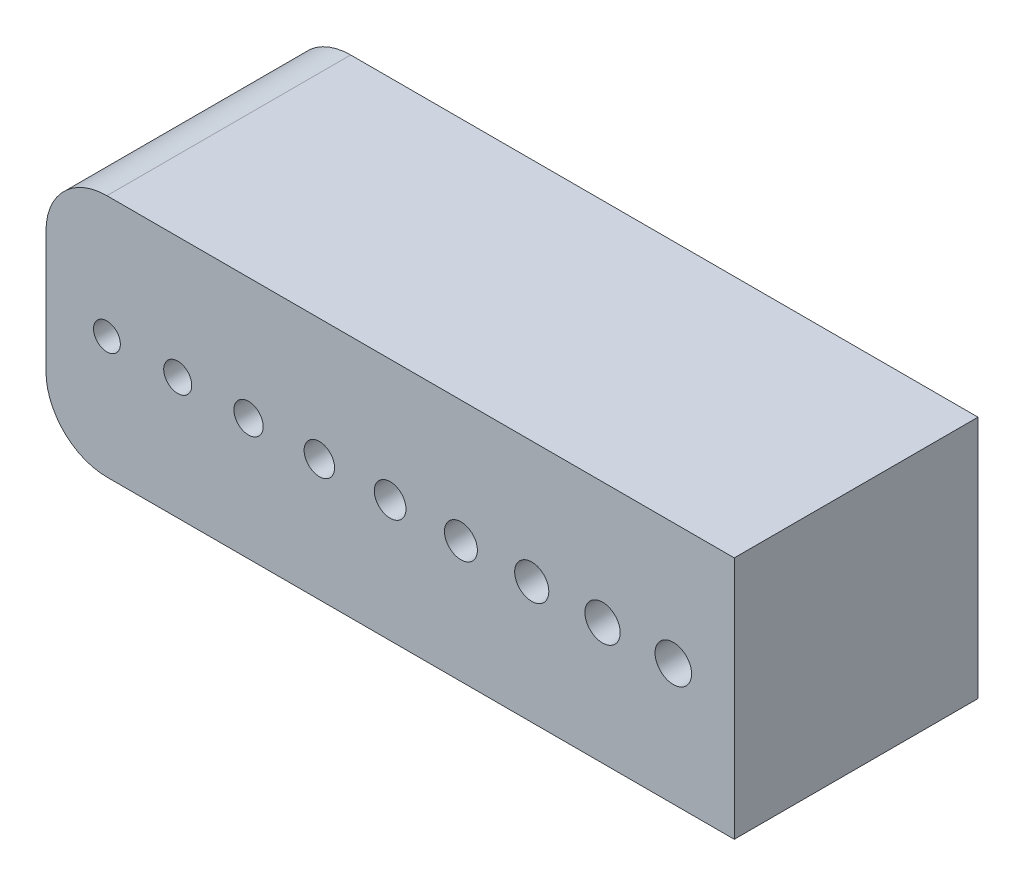
ISO-10303-21;
HEADER;
FILE_DESCRIPTION(('STEP AP214'),'2;1');
FILE_NAME('part.step','',(''),(''),'','','');
FILE_SCHEMA(('AUTOMOTIVE_DESIGN { 1 0 10303 214 1 1 1 1 }'));
ENDSEC;
DATA;
#1=APPLICATION_CONTEXT('core data for automotive mechanical design processes');
#2=APPLICATION_PROTOCOL_DEFINITION('international standard','automotive_design',2000,#1);
#3=PRODUCT_CONTEXT('',#1,'mechanical');
#4=PRODUCT('Part','Part','',(#3));
#5=PRODUCT_RELATED_PRODUCT_CATEGORY('part','',(#4));
#6=PRODUCT_DEFINITION_FORMATION('','',#4);
#7=PRODUCT_DEFINITION_CONTEXT('part definition',#1,'design');
#8=PRODUCT_DEFINITION('design','',#6,#7);
#9=PRODUCT_DEFINITION_SHAPE('','',#8);
#10=(LENGTH_UNIT() NAMED_UNIT(*) SI_UNIT(.MILLI.,.METRE.));
#11=(NAMED_UNIT(*) PLANE_ANGLE_UNIT() SI_UNIT($,.RADIAN.));
#12=(NAMED_UNIT(*) SI_UNIT($,.STERADIAN.) SOLID_ANGLE_UNIT());
#13=UNCERTAINTY_MEASURE_WITH_UNIT(LENGTH_MEASURE(1.E-05),#10,'distance_accuracy_value','');
#14=(GEOMETRIC_REPRESENTATION_CONTEXT(3) GLOBAL_UNCERTAINTY_ASSIGNED_CONTEXT((#13)) GLOBAL_UNIT_ASSIGNED_CONTEXT((#10,
#11,#12)) REPRESENTATION_CONTEXT('',''));
#15=CARTESIAN_POINT('',(0.,0.,0.));
#16=DIRECTION('',(0.,0.,1.));
#17=DIRECTION('',(1.,0.,0.));
#18=AXIS2_PLACEMENT_3D('',#15,#16,#17);
#19=CARTESIAN_POINT('',(-23.238249127685,5.,20.));
#20=DIRECTION('',(0.,0.,-1.));
#21=DIRECTION('',(-1.,0.,0.));
#22=AXIS2_PLACEMENT_3D('',#19,#20,#21);
#23=PLANE('',#22);
#24=DIRECTION('',(0.,1.,0.));
#25=VECTOR('',#24,1.);
#26=CARTESIAN_POINT('',(28.238249127685,-10.,20.));
#27=LINE('',#26,#25);
#28=CARTESIAN_POINT('',(28.238249127685,-10.,20.));
#29=VERTEX_POINT('',#28);
#30=CARTESIAN_POINT('',(28.238249127685,10.,20.));
#31=VERTEX_POINT('',#30);
#32=EDGE_CURVE('E146',#29,#31,#27,.T.);
#33=ORIENTED_EDGE('',*,*,#32,.T.);
#34=DIRECTION('',(-1.,0.,0.));
#35=VECTOR('',#34,1.);
#36=CARTESIAN_POINT('',(-23.238249127685,10.,20.));
#37=LINE('',#36,#35);
#38=CARTESIAN_POINT('',(-23.238249127685,10.,20.));
#39=VERTEX_POINT('',#38);
#40=EDGE_CURVE('E94',#31,#39,#37,.T.);
#41=ORIENTED_EDGE('',*,*,#40,.T.);
#42=CARTESIAN_POINT('',(-23.238249127685,5.,20.));
#43=DIRECTION('',(0.,0.,1.));
#44=DIRECTION('',(-1.,0.,0.));
#45=AXIS2_PLACEMENT_3D('',#42,#43,#44);
#46=CIRCLE('',#45,5.);
#47=CARTESIAN_POINT('',(-28.238249127685,4.99999999999997,20.));
#48=VERTEX_POINT('',#47);
#49=EDGE_CURVE('E107',#39,#48,#46,.T.);
#50=ORIENTED_EDGE('',*,*,#49,.T.);
#51=DIRECTION('',(0.,-1.,0.));
#52=VECTOR('',#51,1.);
#53=CARTESIAN_POINT('',(-28.238249127685,-4.99999999999997,20.));
#54=LINE('',#53,#52);
#55=CARTESIAN_POINT('',(-28.238249127685,-4.99999999999997,20.));
#56=VERTEX_POINT('',#55);
#57=EDGE_CURVE('E101',#48,#56,#54,.T.);
#58=ORIENTED_EDGE('',*,*,#57,.T.);
#59=CARTESIAN_POINT('',(-23.238249127685,-5.,20.));
#60=DIRECTION('',(0.,0.,1.));
#61=DIRECTION('',(-1.,0.,0.));
#62=AXIS2_PLACEMENT_3D('',#59,#60,#61);
#63=CIRCLE('',#62,5.);
#64=CARTESIAN_POINT('',(-23.238249127685,-10.,20.));
#65=VERTEX_POINT('',#64);
#66=EDGE_CURVE('E105',#56,#65,#63,.T.);
#67=ORIENTED_EDGE('',*,*,#66,.T.);
#68=DIRECTION('',(1.,0.,0.));
#69=VECTOR('',#68,1.);
#70=CARTESIAN_POINT('',(-23.238249127685,-10.,20.));
#71=LINE('',#70,#69);
#72=EDGE_CURVE('E57',#65,#29,#71,.T.);
#73=ORIENTED_EDGE('',*,*,#72,.T.);
#74=EDGE_LOOP('',(#33,#41,#50,#58,#67,#73));
#75=FACE_BOUND('',#74,.T.);
#76=CARTESIAN_POINT('',(-23.238249127685,0.,20.));
#77=DIRECTION('',(0.,0.,1.));
#78=DIRECTION('',(1.,0.,0.));
#79=AXIS2_PLACEMENT_3D('',#76,#77,#78);
#80=CIRCLE('',#79,1.1);
#81=CARTESIAN_POINT('',(-22.138249127685,0.,20.));
#82=VERTEX_POINT('',#81);
#83=EDGE_CURVE('E134',#82,#82,#80,.T.);
#84=ORIENTED_EDGE('',*,*,#83,.F.);
#85=EDGE_LOOP('',(#84));
#86=FACE_BOUND('',#85,.T.);
#87=CARTESIAN_POINT('',(-17.4286868457638,0.,20.));
#88=DIRECTION('',(0.,0.,1.));
#89=DIRECTION('',(1.,0.,0.));
#90=AXIS2_PLACEMENT_3D('',#87,#88,#89);
#91=CIRCLE('',#90,1.15);
#92=CARTESIAN_POINT('',(-16.2786868457638,0.,20.));
#93=VERTEX_POINT('',#92);
#94=EDGE_CURVE('E278',#93,#93,#91,.T.);
#95=ORIENTED_EDGE('',*,*,#94,.F.);
#96=EDGE_LOOP('',(#95));
#97=FACE_BOUND('',#96,.T.);
#98=CARTESIAN_POINT('',(-11.6191245638465,0.,20.));
#99=DIRECTION('',(0.,0.,1.));
#100=DIRECTION('',(1.,0.,0.));
#101=AXIS2_PLACEMENT_3D('',#98,#99,#100);
#102=CIRCLE('',#101,1.2);
#103=CARTESIAN_POINT('',(-10.4191245638465,0.,20.));
#104=VERTEX_POINT('',#103);
#105=EDGE_CURVE('E270',#104,#104,#102,.T.);
#106=ORIENTED_EDGE('',*,*,#105,.F.);
#107=EDGE_LOOP('',(#106));
#108=FACE_BOUND('',#107,.T.);
#109=CARTESIAN_POINT('',(-5.80956228192125,0.,20.));
#110=DIRECTION('',(0.,0.,1.));
#111=DIRECTION('',(1.,0.,0.));
#112=AXIS2_PLACEMENT_3D('',#109,#110,#111);
#113=CIRCLE('',#112,1.25);
#114=CARTESIAN_POINT('',(-4.55956228192125,0.,20.));
#115=VERTEX_POINT('',#114);
#116=EDGE_CURVE('E262',#115,#115,#113,.T.);
#117=ORIENTED_EDGE('',*,*,#116,.F.);
#118=EDGE_LOOP('',(#117));
#119=FACE_BOUND('',#118,.T.);
#120=CARTESIAN_POINT('',(0.,0.,20.));
#121=DIRECTION('',(0.,0.,1.));
#122=DIRECTION('',(1.,0.,0.));
#123=AXIS2_PLACEMENT_3D('',#120,#121,#122);
#124=CIRCLE('',#123,1.3);
#125=CARTESIAN_POINT('',(1.30000000000001,0.,20.));
#126=VERTEX_POINT('',#125);
#127=EDGE_CURVE('E254',#126,#126,#124,.T.);
#128=ORIENTED_EDGE('',*,*,#127,.F.);
#129=EDGE_LOOP('',(#128));
#130=FACE_BOUND('',#129,.T.);
#131=CARTESIAN_POINT('',(5.80956228192126,0.,20.));
#132=DIRECTION('',(0.,0.,1.));
#133=DIRECTION('',(1.,0.,0.));
#134=AXIS2_PLACEMENT_3D('',#131,#132,#133);
#135=CIRCLE('',#134,1.35);
#136=CARTESIAN_POINT('',(7.15956228192126,0.,20.));
#137=VERTEX_POINT('',#136);
#138=EDGE_CURVE('E246',#137,#137,#135,.T.);
#139=ORIENTED_EDGE('',*,*,#138,.F.);
#140=EDGE_LOOP('',(#139));
#141=FACE_BOUND('',#140,.T.);
#142=CARTESIAN_POINT('',(11.6191245638465,0.,20.));
#143=DIRECTION('',(0.,0.,1.));
#144=DIRECTION('',(1.,0.,0.));
#145=AXIS2_PLACEMENT_3D('',#142,#143,#144);
#146=CIRCLE('',#145,1.4);
#147=CARTESIAN_POINT('',(13.0191245638465,0.,20.));
#148=VERTEX_POINT('',#147);
#149=EDGE_CURVE('E238',#148,#148,#146,.T.);
#150=ORIENTED_EDGE('',*,*,#149,.F.);
#151=EDGE_LOOP('',(#150));
#152=FACE_BOUND('',#151,.T.);
#153=CARTESIAN_POINT('',(17.4286868457638,0.,20.));
#154=DIRECTION('',(0.,0.,1.));
#155=DIRECTION('',(1.,0.,0.));
#156=AXIS2_PLACEMENT_3D('',#153,#154,#155);
#157=CIRCLE('',#156,1.45);
#158=CARTESIAN_POINT('',(18.8786868457638,0.,20.));
#159=VERTEX_POINT('',#158);
#160=EDGE_CURVE('E230',#159,#159,#157,.T.);
#161=ORIENTED_EDGE('',*,*,#160,.F.);
#162=EDGE_LOOP('',(#161));
#163=FACE_BOUND('',#162,.T.);
#164=CARTESIAN_POINT('',(23.2382491276787,0.,20.));
#165=DIRECTION('',(0.,0.,1.));
#166=DIRECTION('',(1.,0.,0.));
#167=AXIS2_PLACEMENT_3D('',#164,#165,#166);
#168=CIRCLE('',#167,1.5);
#169=CARTESIAN_POINT('',(24.7382491276787,0.,20.));
#170=VERTEX_POINT('',#169);
#171=EDGE_CURVE('E219',#170,#170,#168,.T.);
#172=ORIENTED_EDGE('',*,*,#171,.F.);
#173=EDGE_LOOP('',(#172));
#174=FACE_BOUND('',#173,.T.);
#175=ADVANCED_FACE('F39',(#75,#86,#97,#108,#119,#130,#141,#152,#163,#174),#23,.F.);
#176=CARTESIAN_POINT('',(-23.238249127685,5.,0.));
#177=DIRECTION('',(0.,0.,-1.));
#178=DIRECTION('',(-1.,0.,0.));
#179=AXIS2_PLACEMENT_3D('',#176,#177,#178);
#180=PLANE('',#179);
#181=CARTESIAN_POINT('',(17.4286868457638,0.,0.));
#182=DIRECTION('',(0.,0.,1.));
#183=DIRECTION('',(1.,0.,0.));
#184=AXIS2_PLACEMENT_3D('',#181,#182,#183);
#185=CIRCLE('',#184,1.45);
#186=CARTESIAN_POINT('',(18.8786868457638,0.,0.));
#187=VERTEX_POINT('',#186);
#188=EDGE_CURVE('E227',#187,#187,#185,.T.);
#189=ORIENTED_EDGE('',*,*,#188,.T.);
#190=EDGE_LOOP('',(#189));
#191=FACE_BOUND('',#190,.T.);
#192=CARTESIAN_POINT('',(5.80956228192126,0.,0.));
#193=DIRECTION('',(0.,0.,1.));
#194=DIRECTION('',(1.,0.,0.));
#195=AXIS2_PLACEMENT_3D('',#192,#193,#194);
#196=CIRCLE('',#195,1.35);
#197=CARTESIAN_POINT('',(7.15956228192126,0.,0.));
#198=VERTEX_POINT('',#197);
#199=EDGE_CURVE('E242',#198,#198,#196,.T.);
#200=ORIENTED_EDGE('',*,*,#199,.T.);
#201=EDGE_LOOP('',(#200));
#202=FACE_BOUND('',#201,.T.);
#203=CARTESIAN_POINT('',(-5.80956228192125,0.,0.));
#204=DIRECTION('',(0.,0.,1.));
#205=DIRECTION('',(1.,0.,0.));
#206=AXIS2_PLACEMENT_3D('',#203,#204,#205);
#207=CIRCLE('',#206,1.25);
#208=CARTESIAN_POINT('',(-4.55956228192125,0.,0.));
#209=VERTEX_POINT('',#208);
#210=EDGE_CURVE('E258',#209,#209,#207,.T.);
#211=ORIENTED_EDGE('',*,*,#210,.T.);
#212=EDGE_LOOP('',(#211));
#213=FACE_BOUND('',#212,.T.);
#214=CARTESIAN_POINT('',(-17.4286868457638,0.,0.));
#215=DIRECTION('',(0.,0.,1.));
#216=DIRECTION('',(1.,0.,0.));
#217=AXIS2_PLACEMENT_3D('',#214,#215,#216);
#218=CIRCLE('',#217,1.15);
#219=CARTESIAN_POINT('',(-16.2786868457638,0.,0.));
#220=VERTEX_POINT('',#219);
#221=EDGE_CURVE('E274',#220,#220,#218,.T.);
#222=ORIENTED_EDGE('',*,*,#221,.T.);
#223=EDGE_LOOP('',(#222));
#224=FACE_BOUND('',#223,.T.);
#225=DIRECTION('',(0.,1.,0.));
#226=VECTOR('',#225,1.);
#227=CARTESIAN_POINT('',(28.238249127685,-10.,0.));
#228=LINE('',#227,#226);
#229=CARTESIAN_POINT('',(28.238249127685,-10.,0.));
#230=VERTEX_POINT('',#229);
#231=CARTESIAN_POINT('',(28.238249127685,10.,0.));
#232=VERTEX_POINT('',#231);
#233=EDGE_CURVE('E129',#230,#232,#228,.T.);
#234=ORIENTED_EDGE('',*,*,#233,.F.);
#235=DIRECTION('',(1.,0.,0.));
#236=VECTOR('',#235,1.);
#237=CARTESIAN_POINT('',(-23.238249127685,-10.,0.));
#238=LINE('',#237,#236);
#239=CARTESIAN_POINT('',(-23.238249127685,-10.,0.));
#240=VERTEX_POINT('',#239);
#241=EDGE_CURVE('E86',#240,#230,#238,.T.);
#242=ORIENTED_EDGE('',*,*,#241,.F.);
#243=CARTESIAN_POINT('',(-23.238249127685,-5.,0.));
#244=DIRECTION('',(0.,0.,1.));
#245=DIRECTION('',(-1.,0.,0.));
#246=AXIS2_PLACEMENT_3D('',#243,#244,#245);
#247=CIRCLE('',#246,5.);
#248=CARTESIAN_POINT('',(-28.238249127685,-4.99999999999997,0.));
#249=VERTEX_POINT('',#248);
#250=EDGE_CURVE('E80',#249,#240,#247,.T.);
#251=ORIENTED_EDGE('',*,*,#250,.F.);
#252=DIRECTION('',(0.,-1.,0.));
#253=VECTOR('',#252,1.);
#254=CARTESIAN_POINT('',(-28.238249127685,-4.99999999999997,0.));
#255=LINE('',#254,#253);
#256=CARTESIAN_POINT('',(-28.238249127685,4.99999999999997,0.));
#257=VERTEX_POINT('',#256);
#258=EDGE_CURVE('E116',#257,#249,#255,.T.);
#259=ORIENTED_EDGE('',*,*,#258,.F.);
#260=CARTESIAN_POINT('',(-23.238249127685,5.,0.));
#261=DIRECTION('',(0.,0.,1.));
#262=DIRECTION('',(-1.,0.,0.));
#263=AXIS2_PLACEMENT_3D('',#260,#261,#262);
#264=CIRCLE('',#263,5.);
#265=CARTESIAN_POINT('',(-23.238249127685,10.,0.));
#266=VERTEX_POINT('',#265);
#267=EDGE_CURVE('E137',#266,#257,#264,.T.);
#268=ORIENTED_EDGE('',*,*,#267,.F.);
#269=DIRECTION('',(-1.,0.,0.));
#270=VECTOR('',#269,1.);
#271=CARTESIAN_POINT('',(-23.238249127685,10.,0.));
#272=LINE('',#271,#270);
#273=EDGE_CURVE('E133',#232,#266,#272,.T.);
#274=ORIENTED_EDGE('',*,*,#273,.F.);
#275=EDGE_LOOP('',(#234,#242,#251,#259,#268,#274));
#276=FACE_BOUND('',#275,.T.);
#277=CARTESIAN_POINT('',(-23.238249127685,0.,0.));
#278=DIRECTION('',(0.,0.,1.));
#279=DIRECTION('',(1.,0.,0.));
#280=AXIS2_PLACEMENT_3D('',#277,#278,#279);
#281=CIRCLE('',#280,1.1);
#282=CARTESIAN_POINT('',(-22.138249127685,0.,0.));
#283=VERTEX_POINT('',#282);
#284=EDGE_CURVE('E282',#283,#283,#281,.T.);
#285=ORIENTED_EDGE('',*,*,#284,.T.);
#286=EDGE_LOOP('',(#285));
#287=FACE_BOUND('',#286,.T.);
#288=CARTESIAN_POINT('',(-11.6191245638465,0.,0.));
#289=DIRECTION('',(0.,0.,1.));
#290=DIRECTION('',(1.,0.,0.));
#291=AXIS2_PLACEMENT_3D('',#288,#289,#290);
#292=CIRCLE('',#291,1.2);
#293=CARTESIAN_POINT('',(-10.4191245638465,0.,0.));
#294=VERTEX_POINT('',#293);
#295=EDGE_CURVE('E266',#294,#294,#292,.T.);
#296=ORIENTED_EDGE('',*,*,#295,.T.);
#297=EDGE_LOOP('',(#296));
#298=FACE_BOUND('',#297,.T.);
#299=CARTESIAN_POINT('',(0.,0.,0.));
#300=DIRECTION('',(0.,0.,1.));
#301=DIRECTION('',(1.,0.,0.));
#302=AXIS2_PLACEMENT_3D('',#299,#300,#301);
#303=CIRCLE('',#302,1.3);
#304=CARTESIAN_POINT('',(1.30000000000001,0.,0.));
#305=VERTEX_POINT('',#304);
#306=EDGE_CURVE('E250',#305,#305,#303,.T.);
#307=ORIENTED_EDGE('',*,*,#306,.T.);
#308=EDGE_LOOP('',(#307));
#309=FACE_BOUND('',#308,.T.);
#310=CARTESIAN_POINT('',(11.6191245638465,0.,0.));
#311=DIRECTION('',(0.,0.,1.));
#312=DIRECTION('',(1.,0.,0.));
#313=AXIS2_PLACEMENT_3D('',#310,#311,#312);
#314=CIRCLE('',#313,1.4);
#315=CARTESIAN_POINT('',(13.0191245638465,0.,0.));
#316=VERTEX_POINT('',#315);
#317=EDGE_CURVE('E234',#316,#316,#314,.T.);
#318=ORIENTED_EDGE('',*,*,#317,.T.);
#319=EDGE_LOOP('',(#318));
#320=FACE_BOUND('',#319,.T.);
#321=CARTESIAN_POINT('',(23.2382491276787,0.,0.));
#322=DIRECTION('',(0.,0.,1.));
#323=DIRECTION('',(1.,0.,0.));
#324=AXIS2_PLACEMENT_3D('',#321,#322,#323);
#325=CIRCLE('',#324,1.5);
#326=CARTESIAN_POINT('',(24.7382491276787,0.,0.));
#327=VERTEX_POINT('',#326);
#328=EDGE_CURVE('E222',#327,#327,#325,.T.);
#329=ORIENTED_EDGE('',*,*,#328,.T.);
#330=EDGE_LOOP('',(#329));
#331=FACE_BOUND('',#330,.T.);
#332=ADVANCED_FACE('F159',(#191,#202,#213,#224,#276,#287,#298,#309,#320,#331),#180,.T.);
#333=CARTESIAN_POINT('',(28.238249127685,-10.,20.));
#334=DIRECTION('',(-1.,0.,0.));
#335=DIRECTION('',(0.,0.,1.));
#336=AXIS2_PLACEMENT_3D('',#333,#334,#335);
#337=PLANE('',#336);
#338=ORIENTED_EDGE('',*,*,#233,.T.);
#339=DIRECTION('',(0.,0.,-1.));
#340=VECTOR('',#339,1.);
#341=CARTESIAN_POINT('',(28.238249127685,10.,20.));
#342=LINE('',#341,#340);
#343=EDGE_CURVE('E11',#31,#232,#342,.T.);
#344=ORIENTED_EDGE('',*,*,#343,.F.);
#345=ORIENTED_EDGE('',*,*,#32,.F.);
#346=DIRECTION('',(0.,0.,-1.));
#347=VECTOR('',#346,1.);
#348=CARTESIAN_POINT('',(28.238249127685,-10.,20.));
#349=LINE('',#348,#347);
#350=EDGE_CURVE('E125',#29,#230,#349,.T.);
#351=ORIENTED_EDGE('',*,*,#350,.T.);
#352=EDGE_LOOP('',(#338,#344,#345,#351));
#353=FACE_BOUND('',#352,.T.);
#354=ADVANCED_FACE('F41',(#353),#337,.F.);
#355=CARTESIAN_POINT('',(-23.238249127685,10.,20.));
#356=DIRECTION('',(0.,-1.,0.));
#357=DIRECTION('',(0.,0.,-1.));
#358=AXIS2_PLACEMENT_3D('',#355,#356,#357);
#359=PLANE('',#358);
#360=ORIENTED_EDGE('',*,*,#273,.T.);
#361=DIRECTION('',(0.,0.,-1.));
#362=VECTOR('',#361,1.);
#363=CARTESIAN_POINT('',(-23.238249127685,10.,20.));
#364=LINE('',#363,#362);
#365=EDGE_CURVE('E49',#39,#266,#364,.T.);
#366=ORIENTED_EDGE('',*,*,#365,.F.);
#367=ORIENTED_EDGE('',*,*,#40,.F.);
#368=ORIENTED_EDGE('',*,*,#343,.T.);
#369=EDGE_LOOP('',(#360,#366,#367,#368));
#370=FACE_BOUND('',#369,.T.);
#371=ADVANCED_FACE('F393',(#370),#359,.F.);
#372=CARTESIAN_POINT('',(-23.238249127685,5.,20.));
#373=DIRECTION('',(0.,0.,-1.));
#374=DIRECTION('',(-1.,0.,0.));
#375=AXIS2_PLACEMENT_3D('',#372,#373,#374);
#376=CYLINDRICAL_SURFACE('',#375,5.);
#377=ORIENTED_EDGE('',*,*,#267,.T.);
#378=DIRECTION('',(0.,0.,-1.));
#379=VECTOR('',#378,1.);
#380=CARTESIAN_POINT('',(-28.238249127685,4.99999999999997,20.));
#381=LINE('',#380,#379);
#382=EDGE_CURVE('E118',#48,#257,#381,.T.);
#383=ORIENTED_EDGE('',*,*,#382,.F.);
#384=ORIENTED_EDGE('',*,*,#49,.F.);
#385=ORIENTED_EDGE('',*,*,#365,.T.);
#386=EDGE_LOOP('',(#377,#383,#384,#385));
#387=FACE_BOUND('',#386,.T.);
#388=ADVANCED_FACE('F156',(#387),#376,.T.);
#389=CARTESIAN_POINT('',(-28.238249127685,-4.99999999999997,20.));
#390=DIRECTION('',(1.,0.,0.));
#391=DIRECTION('',(0.,0.,-1.));
#392=AXIS2_PLACEMENT_3D('',#389,#390,#391);
#393=PLANE('',#392);
#394=ORIENTED_EDGE('',*,*,#258,.T.);
#395=DIRECTION('',(0.,0.,-1.));
#396=VECTOR('',#395,1.);
#397=CARTESIAN_POINT('',(-28.238249127685,-4.99999999999997,20.));
#398=LINE('',#397,#396);
#399=EDGE_CURVE('E113',#56,#249,#398,.T.);
#400=ORIENTED_EDGE('',*,*,#399,.F.);
#401=ORIENTED_EDGE('',*,*,#57,.F.);
#402=ORIENTED_EDGE('',*,*,#382,.T.);
#403=EDGE_LOOP('',(#394,#400,#401,#402));
#404=FACE_BOUND('',#403,.T.);
#405=ADVANCED_FACE('F114',(#404),#393,.F.);
#406=CARTESIAN_POINT('',(-23.238249127685,-5.,20.));
#407=DIRECTION('',(0.,0.,-1.));
#408=DIRECTION('',(-1.,0.,0.));
#409=AXIS2_PLACEMENT_3D('',#406,#407,#408);
#410=CYLINDRICAL_SURFACE('',#409,5.);
#411=ORIENTED_EDGE('',*,*,#250,.T.);
#412=DIRECTION('',(0.,0.,-1.));
#413=VECTOR('',#412,1.);
#414=CARTESIAN_POINT('',(-23.238249127685,-10.,20.));
#415=LINE('',#414,#413);
#416=EDGE_CURVE('E119',#65,#240,#415,.T.);
#417=ORIENTED_EDGE('',*,*,#416,.F.);
#418=ORIENTED_EDGE('',*,*,#66,.F.);
#419=ORIENTED_EDGE('',*,*,#399,.T.);
#420=EDGE_LOOP('',(#411,#417,#418,#419));
#421=FACE_BOUND('',#420,.T.);
#422=ADVANCED_FACE('F121',(#421),#410,.T.);
#423=CARTESIAN_POINT('',(-23.238249127685,-10.,20.));
#424=DIRECTION('',(0.,1.,0.));
#425=DIRECTION('',(0.,0.,1.));
#426=AXIS2_PLACEMENT_3D('',#423,#424,#425);
#427=PLANE('',#426);
#428=ORIENTED_EDGE('',*,*,#241,.T.);
#429=ORIENTED_EDGE('',*,*,#350,.F.);
#430=ORIENTED_EDGE('',*,*,#72,.F.);
#431=ORIENTED_EDGE('',*,*,#416,.T.);
#432=EDGE_LOOP('',(#428,#429,#430,#431));
#433=FACE_BOUND('',#432,.T.);
#434=ADVANCED_FACE('F164',(#433),#427,.F.);
#435=CARTESIAN_POINT('',(-23.238249127685,0.,20.));
#436=DIRECTION('',(0.,0.,-1.));
#437=DIRECTION('',(-1.,0.,0.));
#438=AXIS2_PLACEMENT_3D('',#435,#436,#437);
#439=CYLINDRICAL_SURFACE('',#438,1.1);
#440=ORIENTED_EDGE('',*,*,#83,.T.);
#441=EDGE_LOOP('',(#440));
#442=FACE_BOUND('',#441,.T.);
#443=ORIENTED_EDGE('',*,*,#284,.F.);
#444=EDGE_LOOP('',(#443));
#445=FACE_BOUND('',#444,.T.);
#446=ADVANCED_FACE('F166',(#442,#445),#439,.F.);
#447=CARTESIAN_POINT('',(-17.4286868457638,0.,20.));
#448=DIRECTION('',(0.,0.,-1.));
#449=DIRECTION('',(-1.,0.,0.));
#450=AXIS2_PLACEMENT_3D('',#447,#448,#449);
#451=CYLINDRICAL_SURFACE('',#450,1.15);
#452=ORIENTED_EDGE('',*,*,#94,.T.);
#453=EDGE_LOOP('',(#452));
#454=FACE_BOUND('',#453,.T.);
#455=ORIENTED_EDGE('',*,*,#221,.F.);
#456=EDGE_LOOP('',(#455));
#457=FACE_BOUND('',#456,.T.);
#458=ADVANCED_FACE('F172',(#454,#457),#451,.F.);
#459=CARTESIAN_POINT('',(-11.6191245638465,0.,20.));
#460=DIRECTION('',(0.,0.,-1.));
#461=DIRECTION('',(-1.,0.,0.));
#462=AXIS2_PLACEMENT_3D('',#459,#460,#461);
#463=CYLINDRICAL_SURFACE('',#462,1.2);
#464=ORIENTED_EDGE('',*,*,#105,.T.);
#465=EDGE_LOOP('',(#464));
#466=FACE_BOUND('',#465,.T.);
#467=ORIENTED_EDGE('',*,*,#295,.F.);
#468=EDGE_LOOP('',(#467));
#469=FACE_BOUND('',#468,.T.);
#470=ADVANCED_FACE('F186',(#466,#469),#463,.F.);
#471=CARTESIAN_POINT('',(-5.80956228192125,0.,20.));
#472=DIRECTION('',(0.,0.,-1.));
#473=DIRECTION('',(-1.,0.,0.));
#474=AXIS2_PLACEMENT_3D('',#471,#472,#473);
#475=CYLINDRICAL_SURFACE('',#474,1.25);
#476=ORIENTED_EDGE('',*,*,#116,.T.);
#477=EDGE_LOOP('',(#476));
#478=FACE_BOUND('',#477,.T.);
#479=ORIENTED_EDGE('',*,*,#210,.F.);
#480=EDGE_LOOP('',(#479));
#481=FACE_BOUND('',#480,.T.);
#482=ADVANCED_FACE('F190',(#478,#481),#475,.F.);
#483=CARTESIAN_POINT('',(0.,0.,20.));
#484=DIRECTION('',(0.,0.,-1.));
#485=DIRECTION('',(-1.,0.,0.));
#486=AXIS2_PLACEMENT_3D('',#483,#484,#485);
#487=CYLINDRICAL_SURFACE('',#486,1.3);
#488=ORIENTED_EDGE('',*,*,#127,.T.);
#489=EDGE_LOOP('',(#488));
#490=FACE_BOUND('',#489,.T.);
#491=ORIENTED_EDGE('',*,*,#306,.F.);
#492=EDGE_LOOP('',(#491));
#493=FACE_BOUND('',#492,.T.);
#494=ADVANCED_FACE('F194',(#490,#493),#487,.F.);
#495=CARTESIAN_POINT('',(5.80956228192126,0.,20.));
#496=DIRECTION('',(0.,0.,-1.));
#497=DIRECTION('',(-1.,0.,0.));
#498=AXIS2_PLACEMENT_3D('',#495,#496,#497);
#499=CYLINDRICAL_SURFACE('',#498,1.35);
#500=ORIENTED_EDGE('',*,*,#138,.T.);
#501=EDGE_LOOP('',(#500));
#502=FACE_BOUND('',#501,.T.);
#503=ORIENTED_EDGE('',*,*,#199,.F.);
#504=EDGE_LOOP('',(#503));
#505=FACE_BOUND('',#504,.T.);
#506=ADVANCED_FACE('F198',(#502,#505),#499,.F.);
#507=CARTESIAN_POINT('',(11.6191245638465,0.,20.));
#508=DIRECTION('',(0.,0.,-1.));
#509=DIRECTION('',(-1.,0.,0.));
#510=AXIS2_PLACEMENT_3D('',#507,#508,#509);
#511=CYLINDRICAL_SURFACE('',#510,1.4);
#512=ORIENTED_EDGE('',*,*,#149,.T.);
#513=EDGE_LOOP('',(#512));
#514=FACE_BOUND('',#513,.T.);
#515=ORIENTED_EDGE('',*,*,#317,.F.);
#516=EDGE_LOOP('',(#515));
#517=FACE_BOUND('',#516,.T.);
#518=ADVANCED_FACE('F202',(#514,#517),#511,.F.);
#519=CARTESIAN_POINT('',(17.4286868457638,0.,20.));
#520=DIRECTION('',(0.,0.,-1.));
#521=DIRECTION('',(-1.,0.,0.));
#522=AXIS2_PLACEMENT_3D('',#519,#520,#521);
#523=CYLINDRICAL_SURFACE('',#522,1.45);
#524=ORIENTED_EDGE('',*,*,#160,.T.);
#525=EDGE_LOOP('',(#524));
#526=FACE_BOUND('',#525,.T.);
#527=ORIENTED_EDGE('',*,*,#188,.F.);
#528=EDGE_LOOP('',(#527));
#529=FACE_BOUND('',#528,.T.);
#530=ADVANCED_FACE('F206',(#526,#529),#523,.F.);
#531=CARTESIAN_POINT('',(23.2382491276787,0.,20.));
#532=DIRECTION('',(0.,0.,-1.));
#533=DIRECTION('',(-1.,0.,0.));
#534=AXIS2_PLACEMENT_3D('',#531,#532,#533);
#535=CYLINDRICAL_SURFACE('',#534,1.5);
#536=ORIENTED_EDGE('',*,*,#171,.T.);
#537=EDGE_LOOP('',(#536));
#538=FACE_BOUND('',#537,.T.);
#539=ORIENTED_EDGE('',*,*,#328,.F.);
#540=EDGE_LOOP('',(#539));
#541=FACE_BOUND('',#540,.T.);
#542=ADVANCED_FACE('F210',(#538,#541),#535,.F.);
#543=CLOSED_SHELL('',(#175,#332,#354,#371,#388,#405,#422,#434,#446,#458,#470,#482,#494,#506,
#518,#530,#542));
#544=MANIFOLD_SOLID_BREP('B2',#543);
#545=ADVANCED_BREP_SHAPE_REPRESENTATION('',(#18,#544),#14);
#546=SHAPE_DEFINITION_REPRESENTATION(#9,#545);
ENDSEC;
END-ISO-10303-21;
